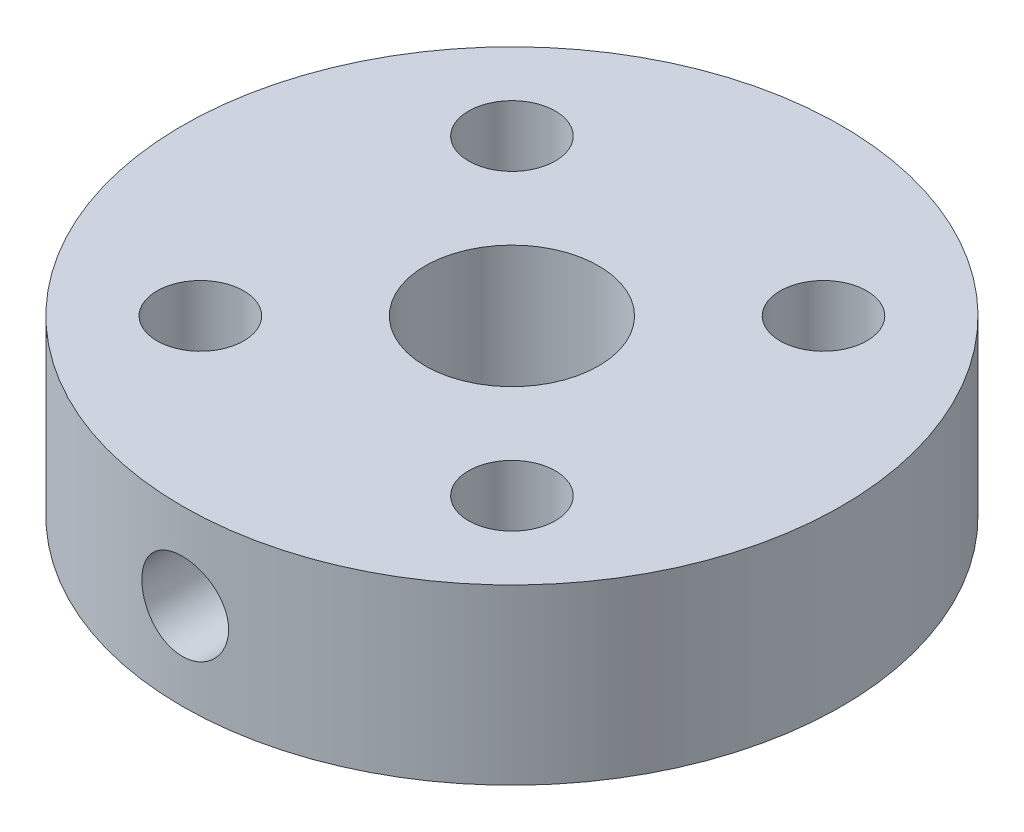
ISO-10303-21;
HEADER;
FILE_DESCRIPTION(('STEP AP214'),'2;1');
FILE_NAME('part.step','',(''),(''),'','','');
FILE_SCHEMA(('AUTOMOTIVE_DESIGN { 1 0 10303 214 1 1 1 1 }'));
ENDSEC;
DATA;
#1=APPLICATION_CONTEXT('core data for automotive mechanical design processes');
#2=APPLICATION_PROTOCOL_DEFINITION('international standard','automotive_design',2000,#1);
#3=PRODUCT_CONTEXT('',#1,'mechanical');
#4=PRODUCT('Part','Part','',(#3));
#5=PRODUCT_RELATED_PRODUCT_CATEGORY('part','',(#4));
#6=PRODUCT_DEFINITION_FORMATION('','',#4);
#7=PRODUCT_DEFINITION_CONTEXT('part definition',#1,'design');
#8=PRODUCT_DEFINITION('design','',#6,#7);
#9=PRODUCT_DEFINITION_SHAPE('','',#8);
#10=(LENGTH_UNIT() NAMED_UNIT(*) SI_UNIT(.MILLI.,.METRE.));
#11=(NAMED_UNIT(*) PLANE_ANGLE_UNIT() SI_UNIT($,.RADIAN.));
#12=(NAMED_UNIT(*) SI_UNIT($,.STERADIAN.) SOLID_ANGLE_UNIT());
#13=UNCERTAINTY_MEASURE_WITH_UNIT(LENGTH_MEASURE(1.E-05),#10,'distance_accuracy_value','');
#14=(GEOMETRIC_REPRESENTATION_CONTEXT(3) GLOBAL_UNCERTAINTY_ASSIGNED_CONTEXT((#13)) GLOBAL_UNIT_ASSIGNED_CONTEXT((#10,
#11,#12)) REPRESENTATION_CONTEXT('',''));
#15=CARTESIAN_POINT('',(0.,0.,0.));
#16=DIRECTION('',(0.,0.,1.));
#17=DIRECTION('',(1.,0.,0.));
#18=AXIS2_PLACEMENT_3D('',#15,#16,#17);
#19=CARTESIAN_POINT('',(0.,5.,0.));
#20=DIRECTION('',(0.,-1.,0.));
#21=DIRECTION('',(0.,0.,-1.));
#22=AXIS2_PLACEMENT_3D('',#19,#20,#21);
#23=CYLINDRICAL_SURFACE('',#22,9.5);
#24=CARTESIAN_POINT('',(1.24999999999999,2.5,9.41740410091868));
#25=CARTESIAN_POINT('',(1.24999704789294,2.43011379465119,9.41740515040742));
#26=CARTESIAN_POINT('',(1.24411931466305,2.36018467255548,9.41819043981181));
#27=CARTESIAN_POINT('',(1.22076605843336,2.22227477521103,9.42124533027014));
#28=CARTESIAN_POINT('',(1.20327861458071,2.15429607758202,9.42351645694713));
#29=CARTESIAN_POINT('',(1.15723232174961,2.02230357984593,9.42928142888536));
#30=CARTESIAN_POINT('',(1.12868122804134,1.95828703876486,9.43277441749336));
#31=CARTESIAN_POINT('',(1.0613351340311,1.83596492220363,9.44058851379835));
#32=CARTESIAN_POINT('',(1.02254180069082,1.77765841950909,9.44490948670654));
#33=CARTESIAN_POINT('',(0.935555536447491,1.66803949801496,9.45392261518461));
#34=CARTESIAN_POINT('',(0.88731182613636,1.61676752761631,9.45861669074954));
#35=CARTESIAN_POINT('',(0.782903691498044,1.52302277326857,9.46782988877771));
#36=CARTESIAN_POINT('',(0.72673886345977,1.48055043807805,9.47234900230879));
#37=CARTESIAN_POINT('',(0.607827237142832,1.40546437122733,9.48072286825033));
#38=CARTESIAN_POINT('',(0.545057022732172,1.37288742035882,9.48457511969083));
#39=CARTESIAN_POINT('',(0.414877343360042,1.31875255294734,9.49116007065744));
#40=CARTESIAN_POINT('',(0.347468068548598,1.29719418506955,9.49389281603899));
#41=CARTESIAN_POINT('',(0.210338313470634,1.265829777398,9.4979173195322));
#42=CARTESIAN_POINT('',(0.140633493799696,1.25595634411622,9.49921733795251));
#43=CARTESIAN_POINT('',(0.000545054460536045,1.2480331155322,9.50025814474571));
#44=CARTESIAN_POINT('',(-0.0698385356541861,1.24998280775371,9.49999900070088));
#45=CARTESIAN_POINT('',(-0.20882774781263,1.26559667926436,9.49795734365724));
#46=CARTESIAN_POINT('',(-0.27744167079196,1.27918837290105,9.4961842570123));
#47=CARTESIAN_POINT('',(-0.411406214346103,1.31758700356618,9.49132449458133));
#48=CARTESIAN_POINT('',(-0.476756767256531,1.3423941730349,9.48823779157073));
#49=CARTESIAN_POINT('',(-0.602562678419363,1.40259594273984,9.48108137373616));
#50=CARTESIAN_POINT('',(-0.663002955821203,1.43802170098394,9.47700877286313));
#51=CARTESIAN_POINT('',(-0.77710814406674,1.51843235628982,9.46833577460663));
#52=CARTESIAN_POINT('',(-0.830772710563958,1.56341773886709,9.46373535042145));
#53=CARTESIAN_POINT('',(-0.93022934908863,1.66207612684238,9.45447999803414));
#54=CARTESIAN_POINT('',(-0.975958735268477,1.7158123342479,9.44982492089106));
#55=CARTESIAN_POINT('',(-1.05775916328446,1.83023047618093,9.44101919770809));
#56=CARTESIAN_POINT('',(-1.09383016863953,1.89091243694228,9.43686855357354));
#57=CARTESIAN_POINT('',(-1.1552946873874,2.01755772705051,9.42954174057462));
#58=CARTESIAN_POINT('',(-1.18068283093785,2.0835236926697,9.42636606200229));
#59=CARTESIAN_POINT('',(-1.22000353371584,2.21883386407496,9.42135807082555));
#60=CARTESIAN_POINT('',(-1.23393670697446,2.28817788857281,9.41952568621592));
#61=CARTESIAN_POINT('',(-1.24986821658865,2.42772111469758,9.41742505133737));
#62=CARTESIAN_POINT('',(-1.25195492887754,2.49791005866249,9.41714521920936));
#63=CARTESIAN_POINT('',(-1.24436778967092,2.63763655644785,9.41815071410225));
#64=CARTESIAN_POINT('',(-1.23469421668077,2.70717412565477,9.41943600405816));
#65=CARTESIAN_POINT('',(-1.20393565087209,2.84335692266034,9.42341633828856));
#66=CARTESIAN_POINT('',(-1.18289375457381,2.91001205346481,9.42610605718738));
#67=CARTESIAN_POINT('',(-1.13004032110575,3.03884829537357,9.43258785218585));
#68=CARTESIAN_POINT('',(-1.09822836711487,3.10102923320538,9.43637997094961));
#69=CARTESIAN_POINT('',(-1.02452177647131,3.21955093973816,9.44466692307172));
#70=CARTESIAN_POINT('',(-0.982569368171468,3.27585549888484,9.44916572917076));
#71=CARTESIAN_POINT('',(-0.889854075114511,3.38065603112853,9.45834681086385));
#72=CARTESIAN_POINT('',(-0.839090809792216,3.42915166676215,9.46302909437602));
#73=CARTESIAN_POINT('',(-0.729807943556213,3.51726989431142,9.47208528996797));
#74=CARTESIAN_POINT('',(-0.671241214786122,3.55683429095804,9.47645705911991));
#75=CARTESIAN_POINT('',(-0.54824205618629,3.62556359939876,9.48436730464789));
#76=CARTESIAN_POINT('',(-0.483809755416958,3.65472873993871,9.48790579935237));
#77=CARTESIAN_POINT('',(-0.351098939428549,3.70173630666016,9.49374132443193));
#78=CARTESIAN_POINT('',(-0.282832344858819,3.71961191690473,9.49604199025897));
#79=CARTESIAN_POINT('',(-0.144234307708315,3.74364082577519,9.49915777375567));
#80=CARTESIAN_POINT('',(-0.0739029690011523,3.74979471307749,9.49997296602718));
#81=CARTESIAN_POINT('',(0.066260830819182,3.75019366185716,9.50002550419145));
#82=CARTESIAN_POINT('',(0.136093049401174,3.7445282840751,9.49927471634213));
#83=CARTESIAN_POINT('',(0.273803441283064,3.72163976918597,9.49630331821968));
#84=CARTESIAN_POINT('',(0.341681617009847,3.70441664643406,9.49408270977212));
#85=CARTESIAN_POINT('',(0.473542173562014,3.65893059252178,9.48842002745292));
#86=CARTESIAN_POINT('',(0.53752622321185,3.63067242947668,9.48497848119331));
#87=CARTESIAN_POINT('',(0.659858449122195,3.56392774970724,9.47725424463943));
#88=CARTESIAN_POINT('',(0.718206529238155,3.52544105853543,9.47297153999953));
#89=CARTESIAN_POINT('',(0.828067366506163,3.43900219469073,9.46400385926268));
#90=CARTESIAN_POINT('',(0.87952755276356,3.39098348067506,9.45931619411569));
#91=CARTESIAN_POINT('',(0.973693877727895,3.28698264817582,9.45008808874873));
#92=CARTESIAN_POINT('',(1.01639794604751,3.23099865158669,9.44554768356159));
#93=CARTESIAN_POINT('',(1.09199840888498,3.11237952083108,9.43710744957151));
#94=CARTESIAN_POINT('',(1.12485205925341,3.04971695441198,9.43321044460901));
#95=CARTESIAN_POINT('',(1.17952229042332,2.91974623395631,9.42653130552799));
#96=CARTESIAN_POINT('',(1.20135074085916,2.85244316497739,9.42374797311329));
#97=CARTESIAN_POINT('',(1.22819129159687,2.73733543112762,9.42027915781916));
#98=CARTESIAN_POINT('',(1.23635761509664,2.69025340647348,9.41920646480158));
#99=CARTESIAN_POINT('',(1.24726295373765,2.5954542589192,9.41776858101801));
#100=CARTESIAN_POINT('',(1.25000201649455,2.54773714159469,9.41740338404484));
#101=CARTESIAN_POINT('',(1.24999999999999,2.5,9.41740410091868));
#102=B_SPLINE_CURVE_WITH_KNOTS('',3,(#24,#25,#26,#27,#28,#29,#30,#31,#32,#33,#34,#35,#36,#37,
#38,#39,#40,#41,#42,#43,#44,#45,#46,#47,#48,#49,#50,#51,#52,#53,#54,#55,#56,#57,#58,#59,#60,#61,
#62,#63,#64,#65,#66,#67,#68,#69,#70,#71,#72,#73,#74,#75,#76,#77,#78,#79,#80,#81,#82,#83,#84,#85,
#86,#87,#88,#89,#90,#91,#92,#93,#94,#95,#96,#97,#98,#99,#100,#101),.UNSPECIFIED.,.T.,.F.,(4,2,2,
2,2,2,2,2,2,2,2,2,2,2,2,2,2,2,2,2,2,2,2,2,2,2,2,2,2,2,2,2,2,2,2,2,2,2,4),(0.,0.209484202571714,
0.419183836928697,0.628736743572665,0.838255565722021,1.04893269923856,1.25962057409929,
1.47108224647856,1.68253525643093,1.89276266234726,2.10298095597087,2.31189982011463,
2.52082301429179,2.73036535278697,2.93991833609115,3.15105801722778,3.36219849585733,
3.57344497984325,3.78468013945543,3.99433736908823,4.2039896337458,4.41285264161176,
4.62172373378566,4.83181406846403,5.04191347978167,5.25334471898745,5.4647713071873,
5.67557350690561,5.88636511965186,6.09556525763883,6.30476513579179,6.51387472089918,
6.7229878725974,6.93361567574768,7.14429322463348,7.35587216352334,7.56722283023418,
7.71031637390367,7.85340866214718),.UNSPECIFIED.);
#103=CARTESIAN_POINT('',(1.24999999999999,2.5,9.41740410091868));
#104=VERTEX_POINT('',#103);
#105=EDGE_CURVE('E10',#104,#104,#102,.T.);
#106=ORIENTED_EDGE('',*,*,#105,.T.);
#107=EDGE_LOOP('',(#106));
#108=FACE_BOUND('',#107,.T.);
#109=CARTESIAN_POINT('',(0.,5.,0.));
#110=DIRECTION('',(0.,1.,0.));
#111=DIRECTION('',(0.,0.,1.));
#112=AXIS2_PLACEMENT_3D('',#109,#110,#111);
#113=CIRCLE('',#112,9.5);
#114=CARTESIAN_POINT('',(0.,5.,9.5));
#115=VERTEX_POINT('',#114);
#116=EDGE_CURVE('E48',#115,#115,#113,.T.);
#117=ORIENTED_EDGE('',*,*,#116,.F.);
#118=EDGE_LOOP('',(#117));
#119=FACE_BOUND('',#118,.T.);
#120=CARTESIAN_POINT('',(0.,0.,0.));
#121=DIRECTION('',(0.,1.,0.));
#122=DIRECTION('',(0.,0.,1.));
#123=AXIS2_PLACEMENT_3D('',#120,#121,#122);
#124=CIRCLE('',#123,9.5);
#125=CARTESIAN_POINT('',(0.,0.,9.5));
#126=VERTEX_POINT('',#125);
#127=EDGE_CURVE('E52',#126,#126,#124,.T.);
#128=ORIENTED_EDGE('',*,*,#127,.T.);
#129=EDGE_LOOP('',(#128));
#130=FACE_BOUND('',#129,.T.);
#131=ADVANCED_FACE('F37',(#108,#119,#130),#23,.T.);
#132=CARTESIAN_POINT('',(0.,5.,0.));
#133=DIRECTION('',(0.,1.,0.));
#134=DIRECTION('',(0.,0.,1.));
#135=AXIS2_PLACEMENT_3D('',#132,#133,#134);
#136=PLANE('',#135);
#137=CARTESIAN_POINT('',(4.49012806053457,5.,-4.49012806053459));
#138=DIRECTION('',(0.,1.,0.));
#139=DIRECTION('',(0.,0.,1.));
#140=AXIS2_PLACEMENT_3D('',#137,#138,#139);
#141=CIRCLE('',#140,1.25);
#142=CARTESIAN_POINT('',(4.49012806053457,5.,-3.24012806053459));
#143=VERTEX_POINT('',#142);
#144=EDGE_CURVE('E85',#143,#143,#141,.T.);
#145=ORIENTED_EDGE('',*,*,#144,.F.);
#146=EDGE_LOOP('',(#145));
#147=FACE_BOUND('',#146,.T.);
#148=CARTESIAN_POINT('',(-4.4901280605346,5.,-4.49012806053455));
#149=DIRECTION('',(0.,1.,0.));
#150=DIRECTION('',(0.,0.,1.));
#151=AXIS2_PLACEMENT_3D('',#148,#149,#150);
#152=CIRCLE('',#151,1.25);
#153=CARTESIAN_POINT('',(-4.4901280605346,5.,-3.24012806053455));
#154=VERTEX_POINT('',#153);
#155=EDGE_CURVE('E79',#154,#154,#152,.T.);
#156=ORIENTED_EDGE('',*,*,#155,.F.);
#157=EDGE_LOOP('',(#156));
#158=FACE_BOUND('',#157,.T.);
#159=CARTESIAN_POINT('',(-4.49012806053457,5.,4.49012806053459));
#160=DIRECTION('',(0.,1.,0.));
#161=DIRECTION('',(0.,0.,1.));
#162=AXIS2_PLACEMENT_3D('',#159,#160,#161);
#163=CIRCLE('',#162,1.25);
#164=CARTESIAN_POINT('',(-4.49012806053457,5.,5.74012806053458));
#165=VERTEX_POINT('',#164);
#166=EDGE_CURVE('E73',#165,#165,#163,.T.);
#167=ORIENTED_EDGE('',*,*,#166,.F.);
#168=EDGE_LOOP('',(#167));
#169=FACE_BOUND('',#168,.T.);
#170=CARTESIAN_POINT('',(4.4901280605346,5.,4.49012806053455));
#171=DIRECTION('',(0.,1.,0.));
#172=DIRECTION('',(0.,0.,1.));
#173=AXIS2_PLACEMENT_3D('',#170,#171,#172);
#174=CIRCLE('',#173,1.25);
#175=CARTESIAN_POINT('',(4.4901280605346,5.,5.74012806053455));
#176=VERTEX_POINT('',#175);
#177=EDGE_CURVE('E67',#176,#176,#174,.T.);
#178=ORIENTED_EDGE('',*,*,#177,.F.);
#179=EDGE_LOOP('',(#178));
#180=FACE_BOUND('',#179,.T.);
#181=CARTESIAN_POINT('',(0.,5.,0.));
#182=DIRECTION('',(0.,1.,0.));
#183=DIRECTION('',(0.,0.,1.));
#184=AXIS2_PLACEMENT_3D('',#181,#182,#183);
#185=CIRCLE('',#184,2.5);
#186=CARTESIAN_POINT('',(0.,5.,2.5));
#187=VERTEX_POINT('',#186);
#188=EDGE_CURVE('E61',#187,#187,#185,.T.);
#189=ORIENTED_EDGE('',*,*,#188,.F.);
#190=EDGE_LOOP('',(#189));
#191=FACE_BOUND('',#190,.T.);
#192=ORIENTED_EDGE('',*,*,#116,.T.);
#193=EDGE_LOOP('',(#192));
#194=FACE_BOUND('',#193,.T.);
#195=ADVANCED_FACE('F126',(#147,#158,#169,#180,#191,#194),#136,.T.);
#196=CARTESIAN_POINT('',(0.,0.,0.));
#197=DIRECTION('',(0.,1.,0.));
#198=DIRECTION('',(0.,0.,1.));
#199=AXIS2_PLACEMENT_3D('',#196,#197,#198);
#200=PLANE('',#199);
#201=CARTESIAN_POINT('',(4.49012806053457,0.,-4.49012806053459));
#202=DIRECTION('',(0.,1.,0.));
#203=DIRECTION('',(0.,0.,1.));
#204=AXIS2_PLACEMENT_3D('',#201,#202,#203);
#205=CIRCLE('',#204,1.25);
#206=CARTESIAN_POINT('',(4.49012806053457,0.,-3.24012806053459));
#207=VERTEX_POINT('',#206);
#208=EDGE_CURVE('E82',#207,#207,#205,.T.);
#209=ORIENTED_EDGE('',*,*,#208,.T.);
#210=EDGE_LOOP('',(#209));
#211=FACE_BOUND('',#210,.T.);
#212=CARTESIAN_POINT('',(-4.4901280605346,0.,-4.49012806053455));
#213=DIRECTION('',(0.,1.,0.));
#214=DIRECTION('',(0.,0.,1.));
#215=AXIS2_PLACEMENT_3D('',#212,#213,#214);
#216=CIRCLE('',#215,1.25);
#217=CARTESIAN_POINT('',(-4.4901280605346,0.,-3.24012806053455));
#218=VERTEX_POINT('',#217);
#219=EDGE_CURVE('E76',#218,#218,#216,.T.);
#220=ORIENTED_EDGE('',*,*,#219,.T.);
#221=EDGE_LOOP('',(#220));
#222=FACE_BOUND('',#221,.T.);
#223=CARTESIAN_POINT('',(-4.49012806053457,0.,4.49012806053459));
#224=DIRECTION('',(0.,1.,0.));
#225=DIRECTION('',(0.,0.,1.));
#226=AXIS2_PLACEMENT_3D('',#223,#224,#225);
#227=CIRCLE('',#226,1.25);
#228=CARTESIAN_POINT('',(-4.49012806053457,0.,5.74012806053458));
#229=VERTEX_POINT('',#228);
#230=EDGE_CURVE('E70',#229,#229,#227,.T.);
#231=ORIENTED_EDGE('',*,*,#230,.T.);
#232=EDGE_LOOP('',(#231));
#233=FACE_BOUND('',#232,.T.);
#234=CARTESIAN_POINT('',(4.4901280605346,0.,4.49012806053455));
#235=DIRECTION('',(0.,1.,0.));
#236=DIRECTION('',(0.,0.,1.));
#237=AXIS2_PLACEMENT_3D('',#234,#235,#236);
#238=CIRCLE('',#237,1.25);
#239=CARTESIAN_POINT('',(4.4901280605346,0.,5.74012806053455));
#240=VERTEX_POINT('',#239);
#241=EDGE_CURVE('E64',#240,#240,#238,.T.);
#242=ORIENTED_EDGE('',*,*,#241,.T.);
#243=EDGE_LOOP('',(#242));
#244=FACE_BOUND('',#243,.T.);
#245=CARTESIAN_POINT('',(0.,0.,0.));
#246=DIRECTION('',(0.,1.,0.));
#247=DIRECTION('',(0.,0.,1.));
#248=AXIS2_PLACEMENT_3D('',#245,#246,#247);
#249=CIRCLE('',#248,2.5);
#250=CARTESIAN_POINT('',(0.,0.,2.5));
#251=VERTEX_POINT('',#250);
#252=EDGE_CURVE('E57',#251,#251,#249,.T.);
#253=ORIENTED_EDGE('',*,*,#252,.T.);
#254=EDGE_LOOP('',(#253));
#255=FACE_BOUND('',#254,.T.);
#256=ORIENTED_EDGE('',*,*,#127,.F.);
#257=EDGE_LOOP('',(#256));
#258=FACE_BOUND('',#257,.T.);
#259=ADVANCED_FACE('F121',(#211,#222,#233,#244,#255,#258),#200,.F.);
#260=CARTESIAN_POINT('',(0.,5.,0.));
#261=DIRECTION('',(0.,1.,0.));
#262=DIRECTION('',(0.,0.,1.));
#263=AXIS2_PLACEMENT_3D('',#260,#261,#262);
#264=CYLINDRICAL_SURFACE('',#263,2.5);
#265=CARTESIAN_POINT('',(0.,1.25000000000001,2.5));
#266=CARTESIAN_POINT('',(0.0657149536912328,1.25000412789938,2.49999641755189));
#267=CARTESIAN_POINT('',(0.13150824962254,1.2552125914021,2.49738113774397));
#268=CARTESIAN_POINT('',(0.26115029408553,1.27581610042615,2.48717695046745));
#269=CARTESIAN_POINT('',(0.324995108391878,1.29123049124707,2.47957859786229));
#270=CARTESIAN_POINT('',(0.448666931100716,1.331492260771,2.46020349254139));
#271=CARTESIAN_POINT('',(0.508508503673973,1.35630298031002,2.448442989719));
#272=CARTESIAN_POINT('',(0.623090771008203,1.41446327670618,2.42182220644723));
#273=CARTESIAN_POINT('',(0.677831867487559,1.44781218031107,2.40696217041913));
#274=CARTESIAN_POINT('',(0.784384772202395,1.52439656185663,2.37445322822571));
#275=CARTESIAN_POINT('',(0.835819013902636,1.56810809904956,2.3566899890942));
#276=CARTESIAN_POINT('',(0.930974306083717,1.6631518490588,2.32074962808431));
#277=CARTESIAN_POINT('',(0.974689478883453,1.71448981471556,2.30257220261294));
#278=CARTESIAN_POINT('',(1.05656500056284,1.82810418690423,2.26623688996684));
#279=CARTESIAN_POINT('',(1.09403166943954,1.8909201229324,2.24818983712665));
#280=CARTESIAN_POINT('',(1.15771028361336,2.02295916998277,2.21607473465401));
#281=CARTESIAN_POINT('',(1.18393026870791,2.09217766090344,2.20200384508737));
#282=CARTESIAN_POINT('',(1.22266555273573,2.23083138177741,2.18072333797261));
#283=CARTESIAN_POINT('',(1.23590732135054,2.30000556508424,2.17315339479642));
#284=CARTESIAN_POINT('',(1.25053374163605,2.43997354722435,2.1647736243566));
#285=CARTESIAN_POINT('',(1.25193011046634,2.51076567608894,2.1639571167911));
#286=CARTESIAN_POINT('',(1.24335910896536,2.64285753039421,2.16888662821561));
#287=CARTESIAN_POINT('',(1.23473069942102,2.70428003902881,2.17385954577517));
#288=CARTESIAN_POINT('',(1.20867481132116,2.8246523867163,2.18845285917313));
#289=CARTESIAN_POINT('',(1.19124452987206,2.88360143163164,2.19807473539721));
#290=CARTESIAN_POINT('',(1.1477622254825,2.99903641570707,2.22109345515927));
#291=CARTESIAN_POINT('',(1.12151883389499,3.05543299848223,2.23457300829998));
#292=CARTESIAN_POINT('',(1.061302109585,3.16329286573751,2.26379255351755));
#293=CARTESIAN_POINT('',(1.02732530476558,3.21475391950011,2.27953355975238));
#294=CARTESIAN_POINT('',(0.947582568640979,3.31815156592903,2.31391447379107));
#295=CARTESIAN_POINT('',(0.900868072961596,3.36932109197019,2.33266887795933));
#296=CARTESIAN_POINT('',(0.799444473426711,3.46341927323862,2.36934529125509));
#297=CARTESIAN_POINT('',(0.744731570717851,3.50634399004235,2.38726689948501));
#298=CARTESIAN_POINT('',(0.625645632289805,3.58460707628715,2.42127484103705));
#299=CARTESIAN_POINT('',(0.560941989499256,3.61950059055717,2.43723730202509));
#300=CARTESIAN_POINT('',(0.425582769360992,3.67762128630376,2.46447351401553));
#301=CARTESIAN_POINT('',(0.354931970331592,3.70085773126895,2.47575098679441));
#302=CARTESIAN_POINT('',(0.215958114575874,3.73309425464584,2.49155417176795));
#303=CARTESIAN_POINT('',(0.147926913185403,3.74311404468347,2.4965617287664));
#304=CARTESIAN_POINT('',(0.0109744999366902,3.75183091391811,2.50091266823877));
#305=CARTESIAN_POINT('',(-0.0579462748373781,3.75053335704934,2.5002587340164));
#306=CARTESIAN_POINT('',(-0.189041214982492,3.73724163947655,2.49363990316801));
#307=CARTESIAN_POINT('',(-0.251324260062443,3.72608433408746,2.48809057110237));
#308=CARTESIAN_POINT('',(-0.373008615377395,3.69470241013114,2.47277714143524));
#309=CARTESIAN_POINT('',(-0.432409607113745,3.67447679193329,2.46301257917916));
#310=CARTESIAN_POINT('',(-0.54861076056208,3.62500191695853,2.43980314267087));
#311=CARTESIAN_POINT('',(-0.605287996257691,3.59551118735398,2.42626102212424));
#312=CARTESIAN_POINT('',(-0.713076702123649,3.52861558044244,2.39679967896386));
#313=CARTESIAN_POINT('',(-0.7641857872191,3.4912073317582,2.38087944457231));
#314=CARTESIAN_POINT('',(-0.864709611613314,3.4052994683339,2.34635276671831));
#315=CARTESIAN_POINT('',(-0.913465097280796,3.35607141443304,2.32763606060552));
#316=CARTESIAN_POINT('',(-1.00232040139155,3.25009356091336,2.29077989504843));
#317=CARTESIAN_POINT('',(-1.04241423211355,3.19333860147953,2.27264084226908));
#318=CARTESIAN_POINT('',(-1.11463489312212,3.0704454322496,2.23813990282585));
#319=CARTESIAN_POINT('',(-1.14628186984829,3.00398591723925,2.2219066207934));
#320=CARTESIAN_POINT('',(-1.19760353251725,2.86561241538434,2.19467590460158));
#321=CARTESIAN_POINT('',(-1.21729364485946,2.79370559187351,2.18367172800773));
#322=CARTESIAN_POINT('',(-1.24232710931209,2.65386222142319,2.16951876260834));
#323=CARTESIAN_POINT('',(-1.24886624550107,2.5862071832137,2.16571729325614));
#324=CARTESIAN_POINT('',(-1.25086144297598,2.45069116603659,2.16456693307719));
#325=CARTESIAN_POINT('',(-1.24632230828049,2.38283028907571,2.16721524534441));
#326=CARTESIAN_POINT('',(-1.22740765699032,2.25564562308498,2.17797327562531));
#327=CARTESIAN_POINT('',(-1.21401039292849,2.1961244123195,2.18553868102992));
#328=CARTESIAN_POINT('',(-1.1789691977808,2.08023985071912,2.20463770234897));
#329=CARTESIAN_POINT('',(-1.15732261394976,2.02387752238504,2.21617259462095));
#330=CARTESIAN_POINT('',(-1.10476968162585,1.91171893626674,2.2428566295566));
#331=CARTESIAN_POINT('',(-1.07333892227056,1.85621512271287,2.25819652995239));
#332=CARTESIAN_POINT('',(-1.00268871454579,1.75090682977427,2.29044164543238));
#333=CARTESIAN_POINT('',(-0.963465214048303,1.70110533685189,2.30734767243153));
#334=CARTESIAN_POINT('',(-0.872754158330794,1.60232252205298,2.34327903949141));
#335=CARTESIAN_POINT('',(-0.820355528762706,1.5541761220476,2.36231229139336));
#336=CARTESIAN_POINT('',(-0.707693507775342,1.46717127072046,2.3984719031886));
#337=CARTESIAN_POINT('',(-0.647425904070974,1.42831782571714,2.4155972326005));
#338=CARTESIAN_POINT('',(-0.519914496024927,1.36095454654725,2.44622511981379));
#339=CARTESIAN_POINT('',(-0.452624379918261,1.33251978823571,2.45970120703636));
#340=CARTESIAN_POINT('',(-0.313427626617733,1.28773979010132,2.48126676704332));
#341=CARTESIAN_POINT('',(-0.241534749528952,1.27136019146303,2.48937154216165));
#342=CARTESIAN_POINT('',(-0.140752433104226,1.25762823615519,2.49619327387079));
#343=CARTESIAN_POINT('',(-0.11270234929937,1.25477169892048,2.49761706674002));
#344=CARTESIAN_POINT('',(-0.0564396647589456,1.250956668104,2.49952121222331));
#345=CARTESIAN_POINT('',(-0.028227059559226,1.24999822691101,2.50000153879704));
#346=CARTESIAN_POINT('',(0.,1.25000000000001,2.5));
#347=B_SPLINE_CURVE_WITH_KNOTS('',3,(#265,#266,#267,#268,#269,#270,#271,#272,#273,#274,#275,
#276,#277,#278,#279,#280,#281,#282,#283,#284,#285,#286,#287,#288,#289,#290,#291,#292,#293,#294,
#295,#296,#297,#298,#299,#300,#301,#302,#303,#304,#305,#306,#307,#308,#309,#310,#311,#312,#313,
#314,#315,#316,#317,#318,#319,#320,#321,#322,#323,#324,#325,#326,#327,#328,#329,#330,#331,#332,
#333,#334,#335,#336,#337,#338,#339,#340,#341,#342,#343,#344,#345,#346),.UNSPECIFIED.,.T.,.F.,(4,
2,2,2,2,2,2,2,2,2,2,2,2,2,2,2,2,2,2,2,2,2,2,2,2,2,2,2,2,2,2,2,2,2,2,2,2,2,2,2,4),(0.,
0.197030321775365,0.394435187136495,0.59107769436537,0.787704700726956,0.996227198397606,
1.20490779706754,1.4297715803844,1.6544743487285,1.86572515175286,2.07676696661274,
2.2625714051165,2.44843504907097,2.63862800210608,2.82890651575276,3.04331176667347,
3.25781918248356,3.48228777768049,3.70657771140348,3.9122911308918,4.11790705639343,
4.3075863313265,4.49728652038662,4.69241070034871,4.88761813435422,5.10199513305521,
5.31651985769287,5.5414335269959,5.76605639925969,5.96911634372964,6.17208824825003,
6.35572412805225,6.53941910979594,6.73545570969514,6.93159451423694,7.15156553440619,
7.37165479220712,7.59330017078653,7.81431135781159,7.89894100172118,7.98357298143554),.UNSPECIFIED.);
#348=CARTESIAN_POINT('',(0.,1.25000000000001,2.5));
#349=VERTEX_POINT('',#348);
#350=EDGE_CURVE('E88',#349,#349,#347,.T.);
#351=ORIENTED_EDGE('',*,*,#350,.T.);
#352=EDGE_LOOP('',(#351));
#353=FACE_BOUND('',#352,.T.);
#354=ORIENTED_EDGE('',*,*,#252,.F.);
#355=EDGE_LOOP('',(#354));
#356=FACE_BOUND('',#355,.T.);
#357=ORIENTED_EDGE('',*,*,#188,.T.);
#358=EDGE_LOOP('',(#357));
#359=FACE_BOUND('',#358,.T.);
#360=ADVANCED_FACE('F94',(#353,#356,#359),#264,.F.);
#361=CARTESIAN_POINT('',(4.4901280605346,5.,4.49012806053455));
#362=DIRECTION('',(0.,1.,0.));
#363=DIRECTION('',(0.,0.,1.));
#364=AXIS2_PLACEMENT_3D('',#361,#362,#363);
#365=CYLINDRICAL_SURFACE('',#364,1.25);
#366=ORIENTED_EDGE('',*,*,#241,.F.);
#367=EDGE_LOOP('',(#366));
#368=FACE_BOUND('',#367,.T.);
#369=ORIENTED_EDGE('',*,*,#177,.T.);
#370=EDGE_LOOP('',(#369));
#371=FACE_BOUND('',#370,.T.);
#372=ADVANCED_FACE('F114',(#368,#371),#365,.F.);
#373=CARTESIAN_POINT('',(-4.49012806053457,5.,4.49012806053459));
#374=DIRECTION('',(0.,1.,0.));
#375=DIRECTION('',(0.,0.,1.));
#376=AXIS2_PLACEMENT_3D('',#373,#374,#375);
#377=CYLINDRICAL_SURFACE('',#376,1.25);
#378=ORIENTED_EDGE('',*,*,#230,.F.);
#379=EDGE_LOOP('',(#378));
#380=FACE_BOUND('',#379,.T.);
#381=ORIENTED_EDGE('',*,*,#166,.T.);
#382=EDGE_LOOP('',(#381));
#383=FACE_BOUND('',#382,.T.);
#384=ADVANCED_FACE('F111',(#380,#383),#377,.F.);
#385=CARTESIAN_POINT('',(-4.4901280605346,5.,-4.49012806053455));
#386=DIRECTION('',(0.,1.,0.));
#387=DIRECTION('',(0.,0.,1.));
#388=AXIS2_PLACEMENT_3D('',#385,#386,#387);
#389=CYLINDRICAL_SURFACE('',#388,1.25);
#390=ORIENTED_EDGE('',*,*,#219,.F.);
#391=EDGE_LOOP('',(#390));
#392=FACE_BOUND('',#391,.T.);
#393=ORIENTED_EDGE('',*,*,#155,.T.);
#394=EDGE_LOOP('',(#393));
#395=FACE_BOUND('',#394,.T.);
#396=ADVANCED_FACE('F107',(#392,#395),#389,.F.);
#397=CARTESIAN_POINT('',(4.49012806053457,5.,-4.49012806053459));
#398=DIRECTION('',(0.,1.,0.));
#399=DIRECTION('',(0.,0.,1.));
#400=AXIS2_PLACEMENT_3D('',#397,#398,#399);
#401=CYLINDRICAL_SURFACE('',#400,1.25);
#402=ORIENTED_EDGE('',*,*,#208,.F.);
#403=EDGE_LOOP('',(#402));
#404=FACE_BOUND('',#403,.T.);
#405=ORIENTED_EDGE('',*,*,#144,.T.);
#406=EDGE_LOOP('',(#405));
#407=FACE_BOUND('',#406,.T.);
#408=ADVANCED_FACE('F102',(#404,#407),#401,.F.);
#409=CARTESIAN_POINT('',(0.,2.5,9.5));
#410=DIRECTION('',(0.,0.,1.));
#411=DIRECTION('',(1.,0.,0.));
#412=AXIS2_PLACEMENT_3D('',#409,#410,#411);
#413=CYLINDRICAL_SURFACE('',#412,1.24999999999999);
#414=ORIENTED_EDGE('',*,*,#105,.F.);
#415=EDGE_LOOP('',(#414));
#416=FACE_BOUND('',#415,.T.);
#417=ORIENTED_EDGE('',*,*,#350,.F.);
#418=EDGE_LOOP('',(#417));
#419=FACE_BOUND('',#418,.T.);
#420=ADVANCED_FACE('F98',(#416,#419),#413,.F.);
#421=CLOSED_SHELL('',(#131,#195,#259,#360,#372,#384,#396,#408,#420));
#422=MANIFOLD_SOLID_BREP('B2',#421);
#423=ADVANCED_BREP_SHAPE_REPRESENTATION('',(#18,#422),#14);
#424=SHAPE_DEFINITION_REPRESENTATION(#9,#423);
ENDSEC;
END-ISO-10303-21;
